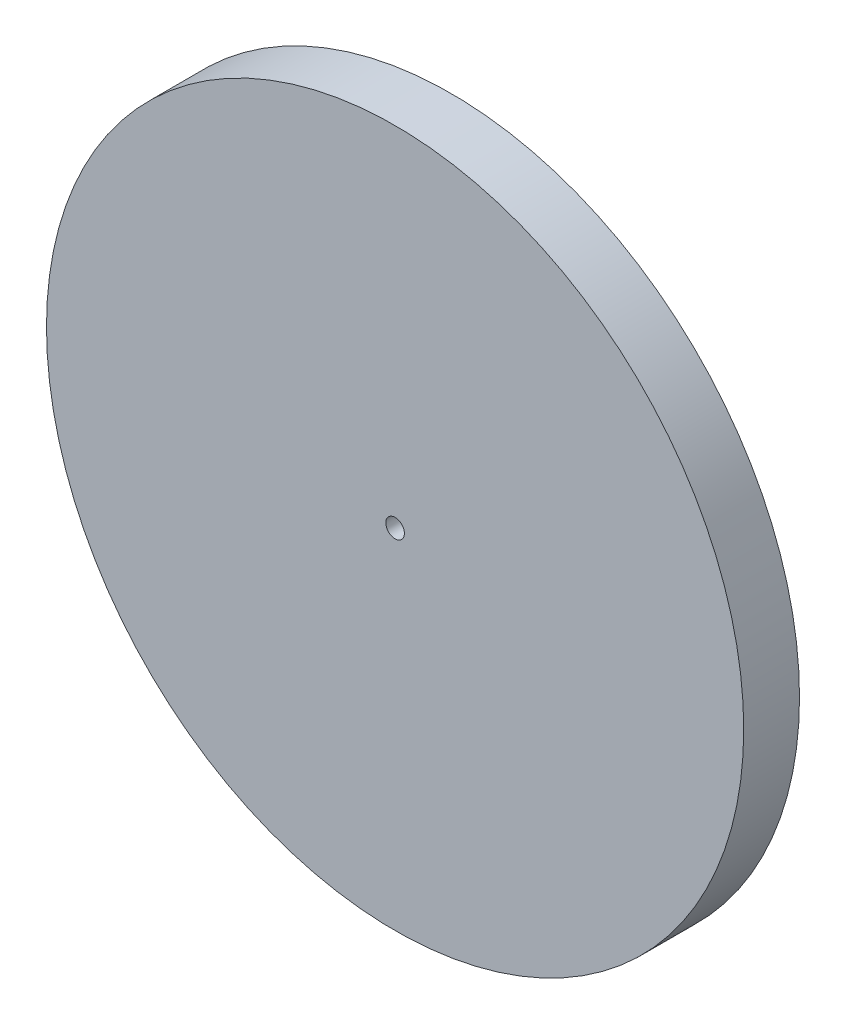
ISO-10303-21;
HEADER;
FILE_DESCRIPTION(('STEP AP214'),'2;1');
FILE_NAME('part.step','',(''),(''),'','','');
FILE_SCHEMA(('AUTOMOTIVE_DESIGN { 1 0 10303 214 1 1 1 1 }'));
ENDSEC;
DATA;
#1=APPLICATION_CONTEXT('core data for automotive mechanical design processes');
#2=APPLICATION_PROTOCOL_DEFINITION('international standard','automotive_design',2000,#1);
#3=PRODUCT_CONTEXT('',#1,'mechanical');
#4=PRODUCT('Part','Part','',(#3));
#5=PRODUCT_RELATED_PRODUCT_CATEGORY('part','',(#4));
#6=PRODUCT_DEFINITION_FORMATION('','',#4);
#7=PRODUCT_DEFINITION_CONTEXT('part definition',#1,'design');
#8=PRODUCT_DEFINITION('design','',#6,#7);
#9=PRODUCT_DEFINITION_SHAPE('','',#8);
#10=(LENGTH_UNIT() NAMED_UNIT(*) SI_UNIT(.MILLI.,.METRE.));
#11=(NAMED_UNIT(*) PLANE_ANGLE_UNIT() SI_UNIT($,.RADIAN.));
#12=(NAMED_UNIT(*) SI_UNIT($,.STERADIAN.) SOLID_ANGLE_UNIT());
#13=UNCERTAINTY_MEASURE_WITH_UNIT(LENGTH_MEASURE(1.E-05),#10,'distance_accuracy_value','');
#14=(GEOMETRIC_REPRESENTATION_CONTEXT(3) GLOBAL_UNCERTAINTY_ASSIGNED_CONTEXT((#13)) GLOBAL_UNIT_ASSIGNED_CONTEXT((#10,
#11,#12)) REPRESENTATION_CONTEXT('',''));
#15=CARTESIAN_POINT('',(0.,0.,0.));
#16=DIRECTION('',(0.,0.,1.));
#17=DIRECTION('',(1.,0.,0.));
#18=AXIS2_PLACEMENT_3D('',#15,#16,#17);
#19=CARTESIAN_POINT('',(0.,0.,6.));
#20=DIRECTION('',(0.,0.,1.));
#21=DIRECTION('',(1.,0.,0.));
#22=AXIS2_PLACEMENT_3D('',#19,#20,#21);
#23=PLANE('',#22);
#24=CARTESIAN_POINT('',(0.,0.,6.));
#25=DIRECTION('',(0.,0.,1.));
#26=DIRECTION('',(1.,0.,0.));
#27=AXIS2_PLACEMENT_3D('',#24,#25,#26);
#28=CIRCLE('',#27,37.5);
#29=CARTESIAN_POINT('',(37.5,0.,6.));
#30=VERTEX_POINT('',#29);
#31=EDGE_CURVE('E10',#30,#30,#28,.T.);
#32=ORIENTED_EDGE('',*,*,#31,.T.);
#33=EDGE_LOOP('',(#32));
#34=FACE_BOUND('',#33,.T.);
#35=CARTESIAN_POINT('',(0.,0.,6.));
#36=DIRECTION('',(0.,0.,1.));
#37=DIRECTION('',(1.,0.,0.));
#38=AXIS2_PLACEMENT_3D('',#35,#36,#37);
#39=CIRCLE('',#38,1.);
#40=CARTESIAN_POINT('',(1.,0.,6.));
#41=VERTEX_POINT('',#40);
#42=EDGE_CURVE('E42',#41,#41,#39,.T.);
#43=ORIENTED_EDGE('',*,*,#42,.F.);
#44=EDGE_LOOP('',(#43));
#45=FACE_BOUND('',#44,.T.);
#46=ADVANCED_FACE('F31',(#34,#45),#23,.T.);
#47=CARTESIAN_POINT('',(0.,0.,0.));
#48=DIRECTION('',(0.,0.,1.));
#49=DIRECTION('',(1.,0.,0.));
#50=AXIS2_PLACEMENT_3D('',#47,#48,#49);
#51=PLANE('',#50);
#52=CARTESIAN_POINT('',(0.,0.,0.));
#53=DIRECTION('',(0.,0.,1.));
#54=DIRECTION('',(1.,0.,0.));
#55=AXIS2_PLACEMENT_3D('',#52,#53,#54);
#56=CIRCLE('',#55,37.5);
#57=CARTESIAN_POINT('',(37.5,0.,0.));
#58=VERTEX_POINT('',#57);
#59=EDGE_CURVE('E35',#58,#58,#56,.T.);
#60=ORIENTED_EDGE('',*,*,#59,.F.);
#61=EDGE_LOOP('',(#60));
#62=FACE_BOUND('',#61,.T.);
#63=CARTESIAN_POINT('',(0.,0.,0.));
#64=DIRECTION('',(0.,0.,1.));
#65=DIRECTION('',(1.,0.,0.));
#66=AXIS2_PLACEMENT_3D('',#63,#64,#65);
#67=CIRCLE('',#66,1.);
#68=CARTESIAN_POINT('',(1.,0.,0.));
#69=VERTEX_POINT('',#68);
#70=EDGE_CURVE('E44',#69,#69,#67,.T.);
#71=ORIENTED_EDGE('',*,*,#70,.T.);
#72=EDGE_LOOP('',(#71));
#73=FACE_BOUND('',#72,.T.);
#74=ADVANCED_FACE('F54',(#62,#73),#51,.F.);
#75=CARTESIAN_POINT('',(0.,0.,6.));
#76=DIRECTION('',(0.,0.,-1.));
#77=DIRECTION('',(-1.,0.,0.));
#78=AXIS2_PLACEMENT_3D('',#75,#76,#77);
#79=CYLINDRICAL_SURFACE('',#78,37.5);
#80=ORIENTED_EDGE('',*,*,#31,.F.);
#81=EDGE_LOOP('',(#80));
#82=FACE_BOUND('',#81,.T.);
#83=ORIENTED_EDGE('',*,*,#59,.T.);
#84=EDGE_LOOP('',(#83));
#85=FACE_BOUND('',#84,.T.);
#86=ADVANCED_FACE('F33',(#82,#85),#79,.T.);
#87=CARTESIAN_POINT('',(0.,0.,6.));
#88=DIRECTION('',(0.,0.,-1.));
#89=DIRECTION('',(-1.,0.,0.));
#90=AXIS2_PLACEMENT_3D('',#87,#88,#89);
#91=CYLINDRICAL_SURFACE('',#90,1.);
#92=ORIENTED_EDGE('',*,*,#42,.T.);
#93=EDGE_LOOP('',(#92));
#94=FACE_BOUND('',#93,.T.);
#95=ORIENTED_EDGE('',*,*,#70,.F.);
#96=EDGE_LOOP('',(#95));
#97=FACE_BOUND('',#96,.T.);
#98=ADVANCED_FACE('F50',(#94,#97),#91,.F.);
#99=CLOSED_SHELL('',(#46,#74,#86,#98));
#100=MANIFOLD_SOLID_BREP('B2',#99);
#101=ADVANCED_BREP_SHAPE_REPRESENTATION('',(#18,#100),#14);
#102=SHAPE_DEFINITION_REPRESENTATION(#9,#101);
ENDSEC;
END-ISO-10303-21;
